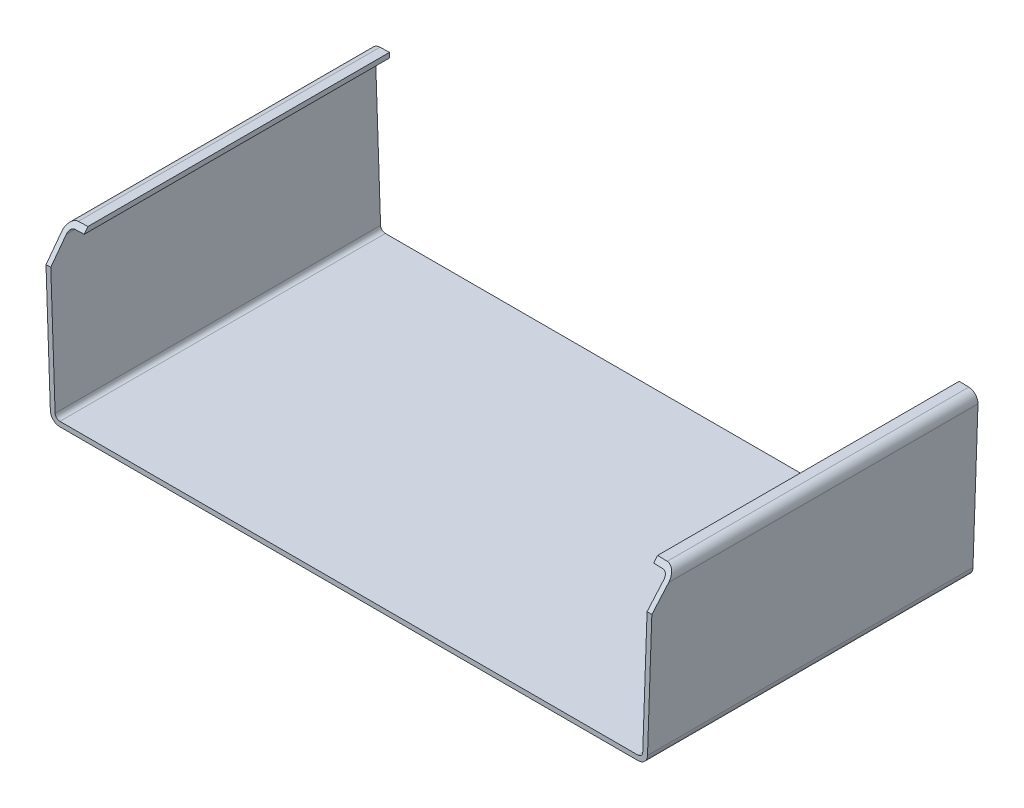
ISO-10303-21;
HEADER;
FILE_DESCRIPTION(('STEP AP214'),'2;1');
FILE_NAME('part.step','',(''),(''),'','','');
FILE_SCHEMA(('AUTOMOTIVE_DESIGN { 1 0 10303 214 1 1 1 1 }'));
ENDSEC;
DATA;
#1=APPLICATION_CONTEXT('core data for automotive mechanical design processes');
#2=APPLICATION_PROTOCOL_DEFINITION('international standard','automotive_design',2000,#1);
#3=PRODUCT_CONTEXT('',#1,'mechanical');
#4=PRODUCT('Part','Part','',(#3));
#5=PRODUCT_RELATED_PRODUCT_CATEGORY('part','',(#4));
#6=PRODUCT_DEFINITION_FORMATION('','',#4);
#7=PRODUCT_DEFINITION_CONTEXT('part definition',#1,'design');
#8=PRODUCT_DEFINITION('design','',#6,#7);
#9=PRODUCT_DEFINITION_SHAPE('','',#8);
#10=(LENGTH_UNIT() NAMED_UNIT(*) SI_UNIT(.MILLI.,.METRE.));
#11=(NAMED_UNIT(*) PLANE_ANGLE_UNIT() SI_UNIT($,.RADIAN.));
#12=(NAMED_UNIT(*) SI_UNIT($,.STERADIAN.) SOLID_ANGLE_UNIT());
#13=UNCERTAINTY_MEASURE_WITH_UNIT(LENGTH_MEASURE(1.E-05),#10,'distance_accuracy_value','');
#14=(GEOMETRIC_REPRESENTATION_CONTEXT(3) GLOBAL_UNCERTAINTY_ASSIGNED_CONTEXT((#13)) GLOBAL_UNIT_ASSIGNED_CONTEXT((#10,
#11,#12)) REPRESENTATION_CONTEXT('',''));
#15=CARTESIAN_POINT('',(0.,0.,0.));
#16=DIRECTION('',(0.,0.,1.));
#17=DIRECTION('',(1.,0.,0.));
#18=AXIS2_PLACEMENT_3D('',#15,#16,#17);
#19=CARTESIAN_POINT('',(-61.5680185949003,1.96509770285898,34.1));
#20=DIRECTION('',(-0.9993907292217,-0.0349022971410098,0.));
#21=DIRECTION('',(0.0349022971410098,-0.9993907292217,0.));
#22=AXIS2_PLACEMENT_3D('',#19,#20,#21);
#23=PLANE('',#22);
#24=DIRECTION('',(-0.0271684032022045,0.777938775156929,-0.627752451189782));
#25=VECTOR('',#24,1.);
#26=CARTESIAN_POINT('',(-61.9263084883444,12.2243536032721,46.8292328661278));
#27=LINE('',#26,#25);
#28=CARTESIAN_POINT('',(-62.4772150285041,27.9989854757474,34.1));
#29=VERTEX_POINT('',#28);
#30=CARTESIAN_POINT('',(-62.6238046764963,32.1964265384786,30.7129032258065));
#31=VERTEX_POINT('',#30);
#32=EDGE_CURVE('E261',#29,#31,#27,.T.);
#33=ORIENTED_EDGE('',*,*,#32,.F.);
#34=DIRECTION('',(-0.0349022971410098,0.9993907292217,0.));
#35=VECTOR('',#34,1.);
#36=CARTESIAN_POINT('',(-61.5680185949003,1.96509770285898,34.1));
#37=LINE('',#36,#35);
#38=CARTESIAN_POINT('',(-61.5680185949003,1.96509770285898,34.1));
#39=VERTEX_POINT('',#38);
#40=EDGE_CURVE('E281',#39,#29,#37,.T.);
#41=ORIENTED_EDGE('',*,*,#40,.F.);
#42=DIRECTION('',(0.,0.,-1.));
#43=VECTOR('',#42,1.);
#44=CARTESIAN_POINT('',(-61.5680185949003,1.96509770285898,34.1));
#45=LINE('',#44,#43);
#46=CARTESIAN_POINT('',(-61.5680185949003,1.96509770285898,-34.1));
#47=VERTEX_POINT('',#46);
#48=EDGE_CURVE('E215',#39,#47,#45,.T.);
#49=ORIENTED_EDGE('',*,*,#48,.T.);
#50=DIRECTION('',(-0.0349022971410098,0.9993907292217,0.));
#51=VECTOR('',#50,1.);
#52=CARTESIAN_POINT('',(-61.5680185949003,1.96509770285898,-34.1));
#53=LINE('',#52,#51);
#54=CARTESIAN_POINT('',(-62.6238046764963,32.1964265384786,-34.1));
#55=VERTEX_POINT('',#54);
#56=EDGE_CURVE('E318',#47,#55,#53,.T.);
#57=ORIENTED_EDGE('',*,*,#56,.T.);
#58=DIRECTION('',(0.,0.,-1.));
#59=VECTOR('',#58,1.);
#60=CARTESIAN_POINT('',(-62.6238046764963,32.1964265384786,34.1));
#61=LINE('',#60,#59);
#62=EDGE_CURVE('E213',#31,#55,#61,.T.);
#63=ORIENTED_EDGE('',*,*,#62,.F.);
#64=EDGE_LOOP('',(#33,#41,#49,#57,#63));
#65=FACE_BOUND('',#64,.T.);
#66=ADVANCED_FACE('F32',(#65),#23,.F.);
#67=CARTESIAN_POINT('',(-61.6244139472746,32.2313288356196,34.1));
#68=DIRECTION('',(0.,0.,-1.));
#69=DIRECTION('',(-1.,0.,0.));
#70=AXIS2_PLACEMENT_3D('',#67,#68,#69);
#71=CYLINDRICAL_SURFACE('',#70,1.);
#72=CARTESIAN_POINT('',(-61.6244139472746,32.2313288356196,30.7129032258065));
#73=DIRECTION('',(-0.0219100025824233,0.627369979965265,0.77841303947533));
#74=DIRECTION('',(-0.0271684032022049,0.777938775156929,-0.627752451189782));
#75=AXIS2_PLACEMENT_3D('',#72,#73,#74);
#76=ELLIPSE('',#75,1.28466501624129,1.);
#77=CARTESIAN_POINT('',(-61.6593162444156,33.2307195648413,29.9064516129032));
#78=VERTEX_POINT('',#77);
#79=EDGE_CURVE('E354',#31,#78,#76,.F.);
#80=ORIENTED_EDGE('',*,*,#79,.F.);
#81=ORIENTED_EDGE('',*,*,#62,.T.);
#82=CARTESIAN_POINT('',(-61.6244139472746,32.2313288356196,-34.1));
#83=DIRECTION('',(0.,0.,-1.));
#84=DIRECTION('',(1.,0.,0.));
#85=AXIS2_PLACEMENT_3D('',#82,#83,#84);
#86=CIRCLE('',#85,1.);
#87=CARTESIAN_POINT('',(-61.6593162444156,33.2307195648413,-34.1));
#88=VERTEX_POINT('',#87);
#89=EDGE_CURVE('E321',#55,#88,#86,.T.);
#90=ORIENTED_EDGE('',*,*,#89,.T.);
#91=DIRECTION('',(0.,0.,-1.));
#92=VECTOR('',#91,1.);
#93=CARTESIAN_POINT('',(-61.6593162444156,33.2307195648413,34.1));
#94=LINE('',#93,#92);
#95=EDGE_CURVE('E211',#78,#88,#94,.T.);
#96=ORIENTED_EDGE('',*,*,#95,.F.);
#97=EDGE_LOOP('',(#80,#81,#90,#96));
#98=FACE_BOUND('',#97,.T.);
#99=ADVANCED_FACE('F427',(#98),#71,.F.);
#100=CARTESIAN_POINT('',(-61.6593162444156,33.2307195648413,34.1));
#101=DIRECTION('',(-0.0349022971410081,0.9993907292217,0.));
#102=DIRECTION('',(-0.9993907292217,-0.0349022971410081,0.));
#103=AXIS2_PLACEMENT_3D('',#100,#101,#102);
#104=PLANE('',#103);
#105=DIRECTION('',(0.9993907292217,0.0349022971410081,0.));
#106=VECTOR('',#105,1.);
#107=CARTESIAN_POINT('',(-61.6593162444156,33.2307195648413,29.9064516129032));
#108=LINE('',#107,#106);
#109=CARTESIAN_POINT('',(-59.658097702859,33.3006092707783,29.9064516129032));
#110=VERTEX_POINT('',#109);
#111=EDGE_CURVE('E356',#78,#110,#108,.T.);
#112=ORIENTED_EDGE('',*,*,#111,.F.);
#113=ORIENTED_EDGE('',*,*,#95,.T.);
#114=DIRECTION('',(0.9993907292217,0.0349022971410081,0.));
#115=VECTOR('',#114,1.);
#116=CARTESIAN_POINT('',(-61.6593162444156,33.2307195648413,-34.1));
#117=LINE('',#116,#115);
#118=CARTESIAN_POINT('',(-59.658097702859,33.3006092707783,-34.1));
#119=VERTEX_POINT('',#118);
#120=EDGE_CURVE('E324',#88,#119,#117,.T.);
#121=ORIENTED_EDGE('',*,*,#120,.T.);
#122=DIRECTION('',(0.,0.,-1.));
#123=VECTOR('',#122,1.);
#124=CARTESIAN_POINT('',(-59.658097702859,33.3006092707783,34.1));
#125=LINE('',#124,#123);
#126=EDGE_CURVE('E209',#110,#119,#125,.T.);
#127=ORIENTED_EDGE('',*,*,#126,.F.);
#128=EDGE_LOOP('',(#112,#113,#121,#127));
#129=FACE_BOUND('',#128,.T.);
#130=ADVANCED_FACE('F430',(#129),#104,.F.);
#131=CARTESIAN_POINT('',(-59.693,34.3,34.1));
#132=DIRECTION('',(-0.9993907292217,-0.03490229714101,0.));
#133=DIRECTION('',(0.03490229714101,-0.9993907292217,0.));
#134=AXIS2_PLACEMENT_3D('',#131,#132,#133);
#135=PLANE('',#134);
#136=DIRECTION('',(-0.0271684032022047,0.777938775156929,-0.627752451189782));
#137=VECTOR('',#136,1.);
#138=CARTESIAN_POINT('',(-59.6077248414745,31.8582351350983,31.0703656998739));
#139=LINE('',#138,#137);
#140=CARTESIAN_POINT('',(-59.693,34.3,29.1));
#141=VERTEX_POINT('',#140);
#142=EDGE_CURVE('E185',#110,#141,#139,.T.);
#143=ORIENTED_EDGE('',*,*,#142,.F.);
#144=ORIENTED_EDGE('',*,*,#126,.T.);
#145=DIRECTION('',(-0.03490229714101,0.9993907292217,0.));
#146=VECTOR('',#145,1.);
#147=CARTESIAN_POINT('',(-59.693,34.3,-34.1));
#148=LINE('',#147,#146);
#149=CARTESIAN_POINT('',(-59.693,34.3,-34.1));
#150=VERTEX_POINT('',#149);
#151=EDGE_CURVE('E327',#119,#150,#148,.T.);
#152=ORIENTED_EDGE('',*,*,#151,.T.);
#153=DIRECTION('',(0.,0.,-1.));
#154=VECTOR('',#153,1.);
#155=CARTESIAN_POINT('',(-59.693,34.3,34.1));
#156=LINE('',#155,#154);
#157=EDGE_CURVE('E202',#141,#150,#156,.T.);
#158=ORIENTED_EDGE('',*,*,#157,.F.);
#159=EDGE_LOOP('',(#143,#144,#152,#158));
#160=FACE_BOUND('',#159,.T.);
#161=ADVANCED_FACE('F366',(#160),#135,.F.);
#162=CARTESIAN_POINT('',(-61.6942185415566,34.230110294063,34.1));
#163=DIRECTION('',(0.0349022971409977,-0.9993907292217,0.));
#164=DIRECTION('',(0.9993907292217,0.0349022971409977,0.));
#165=AXIS2_PLACEMENT_3D('',#162,#163,#164);
#166=PLANE('',#165);
#167=DIRECTION('',(-0.9993907292217,-0.0349022971410102,0.));
#168=VECTOR('',#167,1.);
#169=CARTESIAN_POINT('',(-56.6972648954481,34.404621779768,29.1));
#170=LINE('',#169,#168);
#171=CARTESIAN_POINT('',(-61.6942185415566,34.230110294063,29.1));
#172=VERTEX_POINT('',#171);
#173=EDGE_CURVE('E181',#141,#172,#170,.T.);
#174=ORIENTED_EDGE('',*,*,#173,.F.);
#175=ORIENTED_EDGE('',*,*,#157,.T.);
#176=DIRECTION('',(-0.9993907292217,-0.0349022971409977,0.));
#177=VECTOR('',#176,1.);
#178=CARTESIAN_POINT('',(-61.6942185415566,34.230110294063,-34.1));
#179=LINE('',#178,#177);
#180=CARTESIAN_POINT('',(-61.6942185415566,34.230110294063,-34.1));
#181=VERTEX_POINT('',#180);
#182=EDGE_CURVE('E330',#150,#181,#179,.T.);
#183=ORIENTED_EDGE('',*,*,#182,.T.);
#184=DIRECTION('',(0.,0.,-1.));
#185=VECTOR('',#184,1.);
#186=CARTESIAN_POINT('',(-61.6942185415566,34.230110294063,34.1));
#187=LINE('',#186,#185);
#188=EDGE_CURVE('E199',#172,#181,#187,.T.);
#189=ORIENTED_EDGE('',*,*,#188,.F.);
#190=EDGE_LOOP('',(#174,#175,#183,#189));
#191=FACE_BOUND('',#190,.T.);
#192=ADVANCED_FACE('F365',(#191),#166,.F.);
#193=CARTESIAN_POINT('',(-61.6244139472746,32.2313288356196,34.1));
#194=DIRECTION('',(0.,0.,-1.));
#195=DIRECTION('',(-1.,0.,0.));
#196=AXIS2_PLACEMENT_3D('',#193,#194,#195);
#197=CYLINDRICAL_SURFACE('',#196,2.00000000000001);
#198=CARTESIAN_POINT('',(-61.6244139472746,32.2313288356196,30.7129032258065));
#199=DIRECTION('',(-0.0219100025824233,0.627369979965265,0.77841303947533));
#200=DIRECTION('',(-0.0271684032022049,0.777938775156929,-0.627752451189782));
#201=AXIS2_PLACEMENT_3D('',#198,#199,#200);
#202=ELLIPSE('',#201,2.56933003248257,2.00000000000001);
#203=CARTESIAN_POINT('',(-63.623195405718,32.1615242413376,30.7129032258065));
#204=VERTEX_POINT('',#203);
#205=EDGE_CURVE('E178',#172,#204,#202,.T.);
#206=ORIENTED_EDGE('',*,*,#205,.F.);
#207=ORIENTED_EDGE('',*,*,#188,.T.);
#208=CARTESIAN_POINT('',(-61.6244139472746,32.2313288356196,-34.1));
#209=DIRECTION('',(0.,0.,1.));
#210=DIRECTION('',(1.,0.,0.));
#211=AXIS2_PLACEMENT_3D('',#208,#209,#210);
#212=CIRCLE('',#211,2.00000000000001);
#213=CARTESIAN_POINT('',(-63.623195405718,32.1615242413376,-34.1));
#214=VERTEX_POINT('',#213);
#215=EDGE_CURVE('E197',#181,#214,#212,.T.);
#216=ORIENTED_EDGE('',*,*,#215,.T.);
#217=DIRECTION('',(0.,0.,-1.));
#218=VECTOR('',#217,1.);
#219=CARTESIAN_POINT('',(-63.623195405718,32.1615242413376,34.1));
#220=LINE('',#219,#218);
#221=EDGE_CURVE('E190',#204,#214,#220,.T.);
#222=ORIENTED_EDGE('',*,*,#221,.F.);
#223=EDGE_LOOP('',(#206,#207,#216,#222));
#224=FACE_BOUND('',#223,.T.);
#225=ADVANCED_FACE('F195',(#224),#197,.T.);
#226=CARTESIAN_POINT('',(-62.567409324122,1.93019540571797,34.1));
#227=DIRECTION('',(0.9993907292217,0.0349022971410103,0.));
#228=DIRECTION('',(-0.0349022971410103,0.9993907292217,0.));
#229=AXIS2_PLACEMENT_3D('',#226,#227,#228);
#230=PLANE('',#229);
#231=DIRECTION('',(-0.027168403202205,0.777938775156929,-0.627752451189782));
#232=VECTOR('',#231,1.);
#233=CARTESIAN_POINT('',(-63.693,34.160305699781,29.1));
#234=LINE('',#233,#232);
#235=CARTESIAN_POINT('',(-63.4766057577257,27.9640831786064,34.1));
#236=VERTEX_POINT('',#235);
#237=EDGE_CURVE('E47',#236,#204,#234,.T.);
#238=ORIENTED_EDGE('',*,*,#237,.T.);
#239=ORIENTED_EDGE('',*,*,#221,.T.);
#240=DIRECTION('',(0.0349022971410102,-0.9993907292217,0.));
#241=VECTOR('',#240,1.);
#242=CARTESIAN_POINT('',(-62.567409324122,1.93019540571797,-34.1));
#243=LINE('',#242,#241);
#244=CARTESIAN_POINT('',(-62.567409324122,1.93019540571797,-34.1));
#245=VERTEX_POINT('',#244);
#246=EDGE_CURVE('E333',#214,#245,#243,.T.);
#247=ORIENTED_EDGE('',*,*,#246,.T.);
#248=DIRECTION('',(0.,0.,-1.));
#249=VECTOR('',#248,1.);
#250=CARTESIAN_POINT('',(-62.567409324122,1.93019540571797,34.1));
#251=LINE('',#250,#249);
#252=CARTESIAN_POINT('',(-62.567409324122,1.93019540571797,34.1));
#253=VERTEX_POINT('',#252);
#254=EDGE_CURVE('E200',#253,#245,#251,.T.);
#255=ORIENTED_EDGE('',*,*,#254,.F.);
#256=DIRECTION('',(0.0349022971410102,-0.9993907292217,0.));
#257=VECTOR('',#256,1.);
#258=CARTESIAN_POINT('',(-62.567409324122,1.93019540571797,34.1));
#259=LINE('',#258,#257);
#260=EDGE_CURVE('E193',#236,#253,#259,.T.);
#261=ORIENTED_EDGE('',*,*,#260,.F.);
#262=EDGE_LOOP('',(#238,#239,#247,#255,#261));
#263=FACE_BOUND('',#262,.T.);
#264=ADVANCED_FACE('F189',(#263),#230,.F.);
#265=CARTESIAN_POINT('',(-60.5686278656786,1.99999999999999,34.1));
#266=DIRECTION('',(0.,0.,1.));
#267=DIRECTION('',(1.,0.,0.));
#268=AXIS2_PLACEMENT_3D('',#265,#266,#267);
#269=PLANE('',#268);
#270=ORIENTED_EDGE('',*,*,#40,.T.);
#271=DIRECTION('',(-0.9993907292217,-0.0349022971410103,0.));
#272=VECTOR('',#271,1.);
#273=CARTESIAN_POINT('',(-61.4778242992824,28.0338877728884,34.1));
#274=LINE('',#273,#272);
#275=EDGE_CURVE('E11',#29,#236,#274,.T.);
#276=ORIENTED_EDGE('',*,*,#275,.T.);
#277=ORIENTED_EDGE('',*,*,#260,.T.);
#278=CARTESIAN_POINT('',(-60.5686278656786,1.99999999999999,34.1));
#279=DIRECTION('',(0.,0.,1.));
#280=DIRECTION('',(1.,0.,0.));
#281=AXIS2_PLACEMENT_3D('',#278,#279,#280);
#282=CIRCLE('',#281,2.);
#283=CARTESIAN_POINT('',(-60.5686278656786,0.,34.1));
#284=VERTEX_POINT('',#283);
#285=EDGE_CURVE('E334',#253,#284,#282,.T.);
#286=ORIENTED_EDGE('',*,*,#285,.T.);
#287=DIRECTION('',(1.,0.,0.));
#288=VECTOR('',#287,1.);
#289=CARTESIAN_POINT('',(0.,0.,34.1));
#290=LINE('',#289,#288);
#291=CARTESIAN_POINT('',(60.5686278656786,0.,34.1));
#292=VERTEX_POINT('',#291);
#293=EDGE_CURVE('E272',#284,#292,#290,.T.);
#294=ORIENTED_EDGE('',*,*,#293,.T.);
#295=CARTESIAN_POINT('',(60.5686278656786,1.99999999999999,34.1));
#296=DIRECTION('',(0.,0.,1.));
#297=DIRECTION('',(-1.,0.,0.));
#298=AXIS2_PLACEMENT_3D('',#295,#296,#297);
#299=CIRCLE('',#298,2.);
#300=CARTESIAN_POINT('',(62.567409324122,1.93019540571797,34.1));
#301=VERTEX_POINT('',#300);
#302=EDGE_CURVE('E266',#292,#301,#299,.T.);
#303=ORIENTED_EDGE('',*,*,#302,.T.);
#304=DIRECTION('',(0.0349022971410102,0.9993907292217,0.));
#305=VECTOR('',#304,1.);
#306=CARTESIAN_POINT('',(62.567409324122,1.93019540571797,34.1));
#307=LINE('',#306,#305);
#308=CARTESIAN_POINT('',(63.4766057577258,27.9640831786064,34.1));
#309=VERTEX_POINT('',#308);
#310=EDGE_CURVE('E258',#301,#309,#307,.T.);
#311=ORIENTED_EDGE('',*,*,#310,.T.);
#312=DIRECTION('',(0.9993907292217,-0.0349022971410103,0.));
#313=VECTOR('',#312,1.);
#314=CARTESIAN_POINT('',(-59.511865619381,32.2592802896156,34.1));
#315=LINE('',#314,#313);
#316=CARTESIAN_POINT('',(62.4772150285041,27.9989854757474,34.1));
#317=VERTEX_POINT('',#316);
#318=EDGE_CURVE('E40',#317,#309,#315,.T.);
#319=ORIENTED_EDGE('',*,*,#318,.F.);
#320=DIRECTION('',(-0.0349022971410102,-0.9993907292217,0.));
#321=VECTOR('',#320,1.);
#322=CARTESIAN_POINT('',(61.5680185949003,1.96509770285898,34.1));
#323=LINE('',#322,#321);
#324=CARTESIAN_POINT('',(61.5680185949003,1.96509770285898,34.1));
#325=VERTEX_POINT('',#324);
#326=EDGE_CURVE('E268',#317,#325,#323,.T.);
#327=ORIENTED_EDGE('',*,*,#326,.T.);
#328=CARTESIAN_POINT('',(60.5686278656786,1.99999999999999,34.1));
#329=DIRECTION('',(0.,0.,-1.));
#330=DIRECTION('',(-1.,0.,0.));
#331=AXIS2_PLACEMENT_3D('',#328,#329,#330);
#332=CIRCLE('',#331,0.999999999999997);
#333=CARTESIAN_POINT('',(60.5686278656786,0.999999999999993,34.1));
#334=VERTEX_POINT('',#333);
#335=EDGE_CURVE('E270',#325,#334,#332,.T.);
#336=ORIENTED_EDGE('',*,*,#335,.T.);
#337=DIRECTION('',(-1.,0.,0.));
#338=VECTOR('',#337,1.);
#339=CARTESIAN_POINT('',(0.,1.,34.1));
#340=LINE('',#339,#338);
#341=CARTESIAN_POINT('',(-60.5686278656786,0.999999999999989,34.1));
#342=VERTEX_POINT('',#341);
#343=EDGE_CURVE('E277',#334,#342,#340,.T.);
#344=ORIENTED_EDGE('',*,*,#343,.T.);
#345=CARTESIAN_POINT('',(-60.5686278656786,1.99999999999999,34.1));
#346=DIRECTION('',(0.,0.,-1.));
#347=DIRECTION('',(1.,0.,0.));
#348=AXIS2_PLACEMENT_3D('',#345,#346,#347);
#349=CIRCLE('',#348,1.);
#350=EDGE_CURVE('E279',#342,#39,#349,.T.);
#351=ORIENTED_EDGE('',*,*,#350,.T.);
#352=EDGE_LOOP('',(#270,#276,#277,#286,#294,#303,#311,#319,#327,#336,#344,#351));
#353=FACE_BOUND('',#352,.T.);
#354=ADVANCED_FACE('F264',(#353),#269,.T.);
#355=CARTESIAN_POINT('',(-60.5686278656786,1.99999999999999,34.1));
#356=DIRECTION('',(0.,0.,-1.));
#357=DIRECTION('',(-1.,0.,0.));
#358=AXIS2_PLACEMENT_3D('',#355,#356,#357);
#359=CYLINDRICAL_SURFACE('',#358,2.);
#360=CARTESIAN_POINT('',(-60.5686278656786,1.99999999999999,-34.1));
#361=DIRECTION('',(0.,0.,1.));
#362=DIRECTION('',(1.,0.,0.));
#363=AXIS2_PLACEMENT_3D('',#360,#361,#362);
#364=CIRCLE('',#363,2.);
#365=CARTESIAN_POINT('',(-60.5686278656786,0.,-34.1));
#366=VERTEX_POINT('',#365);
#367=EDGE_CURVE('E284',#245,#366,#364,.T.);
#368=ORIENTED_EDGE('',*,*,#367,.T.);
#369=DIRECTION('',(0.,0.,-1.));
#370=VECTOR('',#369,1.);
#371=CARTESIAN_POINT('',(-60.5686278656786,0.,34.1));
#372=LINE('',#371,#370);
#373=EDGE_CURVE('E245',#284,#366,#372,.T.);
#374=ORIENTED_EDGE('',*,*,#373,.F.);
#375=ORIENTED_EDGE('',*,*,#285,.F.);
#376=ORIENTED_EDGE('',*,*,#254,.T.);
#377=EDGE_LOOP('',(#368,#374,#375,#376));
#378=FACE_BOUND('',#377,.T.);
#379=ADVANCED_FACE('F34',(#378),#359,.T.);
#380=CARTESIAN_POINT('',(0.,0.,34.1));
#381=DIRECTION('',(0.,1.,0.));
#382=DIRECTION('',(-1.,0.,0.));
#383=AXIS2_PLACEMENT_3D('',#380,#381,#382);
#384=PLANE('',#383);
#385=DIRECTION('',(1.,0.,0.));
#386=VECTOR('',#385,1.);
#387=CARTESIAN_POINT('',(0.,0.,-34.1));
#388=LINE('',#387,#386);
#389=CARTESIAN_POINT('',(60.5686278656786,0.,-34.1));
#390=VERTEX_POINT('',#389);
#391=EDGE_CURVE('E287',#366,#390,#388,.T.);
#392=ORIENTED_EDGE('',*,*,#391,.T.);
#393=DIRECTION('',(0.,0.,-1.));
#394=VECTOR('',#393,1.);
#395=CARTESIAN_POINT('',(60.5686278656786,0.,34.1));
#396=LINE('',#395,#394);
#397=EDGE_CURVE('E242',#292,#390,#396,.T.);
#398=ORIENTED_EDGE('',*,*,#397,.F.);
#399=ORIENTED_EDGE('',*,*,#293,.F.);
#400=ORIENTED_EDGE('',*,*,#373,.T.);
#401=EDGE_LOOP('',(#392,#398,#399,#400));
#402=FACE_BOUND('',#401,.T.);
#403=ADVANCED_FACE('F376',(#402),#384,.F.);
#404=CARTESIAN_POINT('',(60.5686278656786,1.99999999999999,34.1));
#405=DIRECTION('',(0.,0.,-1.));
#406=DIRECTION('',(-1.,0.,0.));
#407=AXIS2_PLACEMENT_3D('',#404,#405,#406);
#408=CYLINDRICAL_SURFACE('',#407,2.);
#409=CARTESIAN_POINT('',(60.5686278656786,1.99999999999999,-34.1));
#410=DIRECTION('',(0.,0.,1.));
#411=DIRECTION('',(-1.,0.,0.));
#412=AXIS2_PLACEMENT_3D('',#409,#410,#411);
#413=CIRCLE('',#412,2.);
#414=CARTESIAN_POINT('',(62.567409324122,1.93019540571797,-34.1));
#415=VERTEX_POINT('',#414);
#416=EDGE_CURVE('E290',#390,#415,#413,.T.);
#417=ORIENTED_EDGE('',*,*,#416,.T.);
#418=DIRECTION('',(0.,0.,-1.));
#419=VECTOR('',#418,1.);
#420=CARTESIAN_POINT('',(62.567409324122,1.93019540571797,34.1));
#421=LINE('',#420,#419);
#422=EDGE_CURVE('E239',#301,#415,#421,.T.);
#423=ORIENTED_EDGE('',*,*,#422,.F.);
#424=ORIENTED_EDGE('',*,*,#302,.F.);
#425=ORIENTED_EDGE('',*,*,#397,.T.);
#426=EDGE_LOOP('',(#417,#423,#424,#425));
#427=FACE_BOUND('',#426,.T.);
#428=ADVANCED_FACE('F379',(#427),#408,.T.);
#429=CARTESIAN_POINT('',(62.567409324122,1.93019540571797,34.1));
#430=DIRECTION('',(-0.9993907292217,0.0349022971410103,0.));
#431=DIRECTION('',(-0.0349022971410103,-0.9993907292217,0.));
#432=AXIS2_PLACEMENT_3D('',#429,#430,#431);
#433=PLANE('',#432);
#434=DIRECTION('',(0.,0.,-1.));
#435=VECTOR('',#434,1.);
#436=CARTESIAN_POINT('',(63.623195405718,32.1615242413376,34.1));
#437=LINE('',#436,#435);
#438=CARTESIAN_POINT('',(63.623195405718,32.1615242413376,30.7129032258065));
#439=VERTEX_POINT('',#438);
#440=CARTESIAN_POINT('',(63.623195405718,32.1615242413376,-34.1));
#441=VERTEX_POINT('',#440);
#442=EDGE_CURVE('E237',#439,#441,#437,.T.);
#443=ORIENTED_EDGE('',*,*,#442,.F.);
#444=DIRECTION('',(0.027168403202205,0.777938775156929,-0.627752451189782));
#445=VECTOR('',#444,1.);
#446=CARTESIAN_POINT('',(63.693,34.160305699781,29.1));
#447=LINE('',#446,#445);
#448=EDGE_CURVE('E249',#309,#439,#447,.T.);
#449=ORIENTED_EDGE('',*,*,#448,.F.);
#450=ORIENTED_EDGE('',*,*,#310,.F.);
#451=ORIENTED_EDGE('',*,*,#422,.T.);
#452=DIRECTION('',(0.0349022971410102,0.9993907292217,0.));
#453=VECTOR('',#452,1.);
#454=CARTESIAN_POINT('',(62.567409324122,1.93019540571797,-34.1));
#455=LINE('',#454,#453);
#456=EDGE_CURVE('E292',#415,#441,#455,.T.);
#457=ORIENTED_EDGE('',*,*,#456,.T.);
#458=EDGE_LOOP('',(#443,#449,#450,#451,#457));
#459=FACE_BOUND('',#458,.T.);
#460=ADVANCED_FACE('F257',(#459),#433,.F.);
#461=CARTESIAN_POINT('',(61.6244139472746,32.2313288356196,34.1));
#462=DIRECTION('',(0.,0.,-1.));
#463=DIRECTION('',(-1.,0.,0.));
#464=AXIS2_PLACEMENT_3D('',#461,#462,#463);
#465=CYLINDRICAL_SURFACE('',#464,2.00000000000001);
#466=DIRECTION('',(0.,0.,-1.));
#467=VECTOR('',#466,1.);
#468=CARTESIAN_POINT('',(61.6942185415566,34.230110294063,34.1));
#469=LINE('',#468,#467);
#470=CARTESIAN_POINT('',(61.6942185415566,34.230110294063,29.1));
#471=VERTEX_POINT('',#470);
#472=CARTESIAN_POINT('',(61.6942185415566,34.230110294063,-34.1));
#473=VERTEX_POINT('',#472);
#474=EDGE_CURVE('E235',#471,#473,#469,.T.);
#475=ORIENTED_EDGE('',*,*,#474,.F.);
#476=CARTESIAN_POINT('',(61.6244139472746,32.2313288356196,30.7129032258065));
#477=DIRECTION('',(-0.0219100025824233,-0.627369979965265,-0.77841303947533));
#478=DIRECTION('',(0.0271684032022049,0.777938775156929,-0.627752451189782));
#479=AXIS2_PLACEMENT_3D('',#476,#477,#478);
#480=ELLIPSE('',#479,2.56933003248257,2.00000000000001);
#481=EDGE_CURVE('E288',#471,#439,#480,.T.);
#482=ORIENTED_EDGE('',*,*,#481,.T.);
#483=ORIENTED_EDGE('',*,*,#442,.T.);
#484=CARTESIAN_POINT('',(61.6244139472746,32.2313288356196,-34.1));
#485=DIRECTION('',(0.,0.,1.));
#486=DIRECTION('',(-1.,0.,0.));
#487=AXIS2_PLACEMENT_3D('',#484,#485,#486);
#488=CIRCLE('',#487,2.00000000000001);
#489=EDGE_CURVE('E294',#441,#473,#488,.T.);
#490=ORIENTED_EDGE('',*,*,#489,.T.);
#491=EDGE_LOOP('',(#475,#482,#483,#490));
#492=FACE_BOUND('',#491,.T.);
#493=ADVANCED_FACE('F386',(#492),#465,.T.);
#494=CARTESIAN_POINT('',(61.6942185415566,34.230110294063,34.1));
#495=DIRECTION('',(-0.0349022971409977,-0.9993907292217,0.));
#496=DIRECTION('',(0.9993907292217,-0.0349022971409977,0.));
#497=AXIS2_PLACEMENT_3D('',#494,#495,#496);
#498=PLANE('',#497);
#499=DIRECTION('',(0.,0.,-1.));
#500=VECTOR('',#499,1.);
#501=CARTESIAN_POINT('',(59.693,34.3,34.1));
#502=LINE('',#501,#500);
#503=CARTESIAN_POINT('',(59.693,34.3,29.1));
#504=VERTEX_POINT('',#503);
#505=CARTESIAN_POINT('',(59.693,34.3,-34.1));
#506=VERTEX_POINT('',#505);
#507=EDGE_CURVE('E233',#504,#506,#502,.T.);
#508=ORIENTED_EDGE('',*,*,#507,.F.);
#509=DIRECTION('',(0.9993907292217,-0.0349022971410102,0.));
#510=VECTOR('',#509,1.);
#511=CARTESIAN_POINT('',(56.6972648954481,34.404621779768,29.1));
#512=LINE('',#511,#510);
#513=EDGE_CURVE('E260',#504,#471,#512,.T.);
#514=ORIENTED_EDGE('',*,*,#513,.T.);
#515=ORIENTED_EDGE('',*,*,#474,.T.);
#516=DIRECTION('',(-0.9993907292217,0.0349022971409977,0.));
#517=VECTOR('',#516,1.);
#518=CARTESIAN_POINT('',(61.6942185415566,34.230110294063,-34.1));
#519=LINE('',#518,#517);
#520=EDGE_CURVE('E297',#473,#506,#519,.T.);
#521=ORIENTED_EDGE('',*,*,#520,.T.);
#522=EDGE_LOOP('',(#508,#514,#515,#521));
#523=FACE_BOUND('',#522,.T.);
#524=ADVANCED_FACE('F389',(#523),#498,.F.);
#525=CARTESIAN_POINT('',(59.693,34.3,34.1));
#526=DIRECTION('',(0.9993907292217,-0.0349022971410098,0.));
#527=DIRECTION('',(0.0349022971410098,0.9993907292217,0.));
#528=AXIS2_PLACEMENT_3D('',#525,#526,#527);
#529=PLANE('',#528);
#530=DIRECTION('',(0.,0.,-1.));
#531=VECTOR('',#530,1.);
#532=CARTESIAN_POINT('',(59.658097702859,33.3006092707783,34.1));
#533=LINE('',#532,#531);
#534=CARTESIAN_POINT('',(59.658097702859,33.3006092707783,29.9064516129032));
#535=VERTEX_POINT('',#534);
#536=CARTESIAN_POINT('',(59.658097702859,33.3006092707783,-34.1));
#537=VERTEX_POINT('',#536);
#538=EDGE_CURVE('E231',#535,#537,#533,.T.);
#539=ORIENTED_EDGE('',*,*,#538,.F.);
#540=DIRECTION('',(0.0271684032022046,0.777938775156929,-0.627752451189782));
#541=VECTOR('',#540,1.);
#542=CARTESIAN_POINT('',(59.6077248414745,31.8582351350983,31.0703656998739));
#543=LINE('',#542,#541);
#544=EDGE_CURVE('E341',#535,#504,#543,.T.);
#545=ORIENTED_EDGE('',*,*,#544,.T.);
#546=ORIENTED_EDGE('',*,*,#507,.T.);
#547=DIRECTION('',(-0.0349022971410098,-0.9993907292217,0.));
#548=VECTOR('',#547,1.);
#549=CARTESIAN_POINT('',(59.693,34.3,-34.1));
#550=LINE('',#549,#548);
#551=EDGE_CURVE('E300',#506,#537,#550,.T.);
#552=ORIENTED_EDGE('',*,*,#551,.T.);
#553=EDGE_LOOP('',(#539,#545,#546,#552));
#554=FACE_BOUND('',#553,.T.);
#555=ADVANCED_FACE('F392',(#554),#529,.F.);
#556=CARTESIAN_POINT('',(61.6593162444156,33.2307195648413,34.1));
#557=DIRECTION('',(0.0349022971409977,0.9993907292217,0.));
#558=DIRECTION('',(-0.9993907292217,0.0349022971409977,0.));
#559=AXIS2_PLACEMENT_3D('',#556,#557,#558);
#560=PLANE('',#559);
#561=DIRECTION('',(0.,0.,-1.));
#562=VECTOR('',#561,1.);
#563=CARTESIAN_POINT('',(61.6593162444156,33.2307195648413,34.1));
#564=LINE('',#563,#562);
#565=CARTESIAN_POINT('',(61.6593162444156,33.2307195648413,29.9064516129032));
#566=VERTEX_POINT('',#565);
#567=CARTESIAN_POINT('',(61.6593162444156,33.2307195648413,-34.1));
#568=VERTEX_POINT('',#567);
#569=EDGE_CURVE('E229',#566,#568,#564,.T.);
#570=ORIENTED_EDGE('',*,*,#569,.F.);
#571=DIRECTION('',(-0.9993907292217,0.0349022971409977,0.));
#572=VECTOR('',#571,1.);
#573=CARTESIAN_POINT('',(61.6593162444155,33.2307195648413,29.9064516129032));
#574=LINE('',#573,#572);
#575=EDGE_CURVE('E344',#566,#535,#574,.T.);
#576=ORIENTED_EDGE('',*,*,#575,.T.);
#577=ORIENTED_EDGE('',*,*,#538,.T.);
#578=DIRECTION('',(0.9993907292217,-0.0349022971409977,0.));
#579=VECTOR('',#578,1.);
#580=CARTESIAN_POINT('',(61.6593162444156,33.2307195648413,-34.1));
#581=LINE('',#580,#579);
#582=EDGE_CURVE('E303',#537,#568,#581,.T.);
#583=ORIENTED_EDGE('',*,*,#582,.T.);
#584=EDGE_LOOP('',(#570,#576,#577,#583));
#585=FACE_BOUND('',#584,.T.);
#586=ADVANCED_FACE('F396',(#585),#560,.F.);
#587=CARTESIAN_POINT('',(61.6244139472746,32.2313288356196,34.1));
#588=DIRECTION('',(0.,0.,-1.));
#589=DIRECTION('',(-1.,0.,0.));
#590=AXIS2_PLACEMENT_3D('',#587,#588,#589);
#591=CYLINDRICAL_SURFACE('',#590,1.00000000000001);
#592=DIRECTION('',(0.,0.,-1.));
#593=VECTOR('',#592,1.);
#594=CARTESIAN_POINT('',(62.6238046764963,32.1964265384786,34.1));
#595=LINE('',#594,#593);
#596=CARTESIAN_POINT('',(62.6238046764963,32.1964265384786,30.7129032258065));
#597=VERTEX_POINT('',#596);
#598=CARTESIAN_POINT('',(62.6238046764963,32.1964265384786,-34.1));
#599=VERTEX_POINT('',#598);
#600=EDGE_CURVE('E227',#597,#599,#595,.T.);
#601=ORIENTED_EDGE('',*,*,#600,.F.);
#602=CARTESIAN_POINT('',(61.6244139472746,32.2313288356196,30.7129032258065));
#603=DIRECTION('',(-0.0219100025824233,-0.627369979965265,-0.77841303947533));
#604=DIRECTION('',(0.0271684032022049,0.777938775156929,-0.627752451189782));
#605=AXIS2_PLACEMENT_3D('',#602,#603,#604);
#606=ELLIPSE('',#605,1.2846650162413,1.00000000000001);
#607=EDGE_CURVE('E347',#597,#566,#606,.F.);
#608=ORIENTED_EDGE('',*,*,#607,.T.);
#609=ORIENTED_EDGE('',*,*,#569,.T.);
#610=CARTESIAN_POINT('',(61.6244139472746,32.2313288356196,-34.1));
#611=DIRECTION('',(0.,0.,-1.));
#612=DIRECTION('',(-1.,0.,0.));
#613=AXIS2_PLACEMENT_3D('',#610,#611,#612);
#614=CIRCLE('',#613,1.00000000000001);
#615=EDGE_CURVE('E306',#568,#599,#614,.T.);
#616=ORIENTED_EDGE('',*,*,#615,.T.);
#617=EDGE_LOOP('',(#601,#608,#609,#616));
#618=FACE_BOUND('',#617,.T.);
#619=ADVANCED_FACE('F400',(#618),#591,.F.);
#620=CARTESIAN_POINT('',(61.5680185949003,1.96509770285898,34.1));
#621=DIRECTION('',(0.9993907292217,-0.0349022971410103,0.));
#622=DIRECTION('',(0.0349022971410103,0.9993907292217,0.));
#623=AXIS2_PLACEMENT_3D('',#620,#621,#622);
#624=PLANE('',#623);
#625=ORIENTED_EDGE('',*,*,#326,.F.);
#626=DIRECTION('',(0.0271684032022049,0.777938775156929,-0.627752451189782));
#627=VECTOR('',#626,1.);
#628=CARTESIAN_POINT('',(61.9263084883444,12.2243536032721,46.8292328661278));
#629=LINE('',#628,#627);
#630=EDGE_CURVE('E54',#317,#597,#629,.T.);
#631=ORIENTED_EDGE('',*,*,#630,.T.);
#632=ORIENTED_EDGE('',*,*,#600,.T.);
#633=DIRECTION('',(-0.0349022971410102,-0.9993907292217,0.));
#634=VECTOR('',#633,1.);
#635=CARTESIAN_POINT('',(61.5680185949003,1.96509770285898,-34.1));
#636=LINE('',#635,#634);
#637=CARTESIAN_POINT('',(61.5680185949003,1.96509770285898,-34.1));
#638=VERTEX_POINT('',#637);
#639=EDGE_CURVE('E309',#599,#638,#636,.T.);
#640=ORIENTED_EDGE('',*,*,#639,.T.);
#641=DIRECTION('',(0.,0.,-1.));
#642=VECTOR('',#641,1.);
#643=CARTESIAN_POINT('',(61.5680185949003,1.96509770285898,34.1));
#644=LINE('',#643,#642);
#645=EDGE_CURVE('E224',#325,#638,#644,.T.);
#646=ORIENTED_EDGE('',*,*,#645,.F.);
#647=EDGE_LOOP('',(#625,#631,#632,#640,#646));
#648=FACE_BOUND('',#647,.T.);
#649=ADVANCED_FACE('F403',(#648),#624,.F.);
#650=CARTESIAN_POINT('',(60.5686278656786,1.99999999999999,34.1));
#651=DIRECTION('',(0.,0.,-1.));
#652=DIRECTION('',(-1.,0.,0.));
#653=AXIS2_PLACEMENT_3D('',#650,#651,#652);
#654=CYLINDRICAL_SURFACE('',#653,0.999999999999997);
#655=CARTESIAN_POINT('',(60.5686278656786,1.99999999999999,-34.1));
#656=DIRECTION('',(0.,0.,-1.));
#657=DIRECTION('',(-1.,0.,0.));
#658=AXIS2_PLACEMENT_3D('',#655,#656,#657);
#659=CIRCLE('',#658,0.999999999999997);
#660=CARTESIAN_POINT('',(60.5686278656786,0.999999999999993,-34.1));
#661=VERTEX_POINT('',#660);
#662=EDGE_CURVE('E311',#638,#661,#659,.T.);
#663=ORIENTED_EDGE('',*,*,#662,.T.);
#664=DIRECTION('',(0.,0.,-1.));
#665=VECTOR('',#664,1.);
#666=CARTESIAN_POINT('',(60.5686278656786,0.999999999999993,34.1));
#667=LINE('',#666,#665);
#668=EDGE_CURVE('E221',#334,#661,#667,.T.);
#669=ORIENTED_EDGE('',*,*,#668,.F.);
#670=ORIENTED_EDGE('',*,*,#335,.F.);
#671=ORIENTED_EDGE('',*,*,#645,.T.);
#672=EDGE_LOOP('',(#663,#669,#670,#671));
#673=FACE_BOUND('',#672,.T.);
#674=ADVANCED_FACE('F410',(#673),#654,.F.);
#675=CARTESIAN_POINT('',(0.,1.,34.1));
#676=DIRECTION('',(0.,-1.,0.));
#677=DIRECTION('',(1.,0.,0.));
#678=AXIS2_PLACEMENT_3D('',#675,#676,#677);
#679=PLANE('',#678);
#680=DIRECTION('',(-1.,0.,0.));
#681=VECTOR('',#680,1.);
#682=CARTESIAN_POINT('',(0.,1.,-34.1));
#683=LINE('',#682,#681);
#684=CARTESIAN_POINT('',(-60.5686278656786,0.999999999999989,-34.1));
#685=VERTEX_POINT('',#684);
#686=EDGE_CURVE('E314',#661,#685,#683,.T.);
#687=ORIENTED_EDGE('',*,*,#686,.T.);
#688=DIRECTION('',(0.,0.,-1.));
#689=VECTOR('',#688,1.);
#690=CARTESIAN_POINT('',(-60.5686278656786,0.999999999999989,34.1));
#691=LINE('',#690,#689);
#692=EDGE_CURVE('E218',#342,#685,#691,.T.);
#693=ORIENTED_EDGE('',*,*,#692,.F.);
#694=ORIENTED_EDGE('',*,*,#343,.F.);
#695=ORIENTED_EDGE('',*,*,#668,.T.);
#696=EDGE_LOOP('',(#687,#693,#694,#695));
#697=FACE_BOUND('',#696,.T.);
#698=ADVANCED_FACE('F413',(#697),#679,.F.);
#699=CARTESIAN_POINT('',(-60.5686278656786,1.99999999999999,34.1));
#700=DIRECTION('',(0.,0.,-1.));
#701=DIRECTION('',(-1.,0.,0.));
#702=AXIS2_PLACEMENT_3D('',#699,#700,#701);
#703=CYLINDRICAL_SURFACE('',#702,1.);
#704=CARTESIAN_POINT('',(-60.5686278656786,1.99999999999999,-34.1));
#705=DIRECTION('',(0.,0.,-1.));
#706=DIRECTION('',(1.,0.,0.));
#707=AXIS2_PLACEMENT_3D('',#704,#705,#706);
#708=CIRCLE('',#707,1.);
#709=EDGE_CURVE('E316',#685,#47,#708,.T.);
#710=ORIENTED_EDGE('',*,*,#709,.T.);
#711=ORIENTED_EDGE('',*,*,#48,.F.);
#712=ORIENTED_EDGE('',*,*,#350,.F.);
#713=ORIENTED_EDGE('',*,*,#692,.T.);
#714=EDGE_LOOP('',(#710,#711,#712,#713));
#715=FACE_BOUND('',#714,.T.);
#716=ADVANCED_FACE('F418',(#715),#703,.F.);
#717=CARTESIAN_POINT('',(-60.5686278656786,1.99999999999999,-34.1));
#718=DIRECTION('',(0.,0.,1.));
#719=DIRECTION('',(1.,0.,0.));
#720=AXIS2_PLACEMENT_3D('',#717,#718,#719);
#721=PLANE('',#720);
#722=ORIENTED_EDGE('',*,*,#367,.F.);
#723=ORIENTED_EDGE('',*,*,#246,.F.);
#724=ORIENTED_EDGE('',*,*,#215,.F.);
#725=ORIENTED_EDGE('',*,*,#182,.F.);
#726=ORIENTED_EDGE('',*,*,#151,.F.);
#727=ORIENTED_EDGE('',*,*,#120,.F.);
#728=ORIENTED_EDGE('',*,*,#89,.F.);
#729=ORIENTED_EDGE('',*,*,#56,.F.);
#730=ORIENTED_EDGE('',*,*,#709,.F.);
#731=ORIENTED_EDGE('',*,*,#686,.F.);
#732=ORIENTED_EDGE('',*,*,#662,.F.);
#733=ORIENTED_EDGE('',*,*,#639,.F.);
#734=ORIENTED_EDGE('',*,*,#615,.F.);
#735=ORIENTED_EDGE('',*,*,#582,.F.);
#736=ORIENTED_EDGE('',*,*,#551,.F.);
#737=ORIENTED_EDGE('',*,*,#520,.F.);
#738=ORIENTED_EDGE('',*,*,#489,.F.);
#739=ORIENTED_EDGE('',*,*,#456,.F.);
#740=ORIENTED_EDGE('',*,*,#416,.F.);
#741=ORIENTED_EDGE('',*,*,#391,.F.);
#742=EDGE_LOOP('',(#722,#723,#724,#725,#726,#727,#728,#729,#730,#731,#732,#733,#734,#735,#736,
#737,#738,#739,#740,#741));
#743=FACE_BOUND('',#742,.T.);
#744=ADVANCED_FACE('F372',(#743),#721,.F.);
#745=CARTESIAN_POINT('',(56.6972648954481,34.404621779768,29.1));
#746=DIRECTION('',(-0.0219100025824233,-0.627369979965265,-0.77841303947533));
#747=DIRECTION('',(0.,0.778599944665,-0.627520618121555));
#748=AXIS2_PLACEMENT_3D('',#745,#746,#747);
#749=PLANE('',#748);
#750=ORIENTED_EDGE('',*,*,#513,.F.);
#751=ORIENTED_EDGE('',*,*,#544,.F.);
#752=ORIENTED_EDGE('',*,*,#575,.F.);
#753=ORIENTED_EDGE('',*,*,#607,.F.);
#754=ORIENTED_EDGE('',*,*,#630,.F.);
#755=ORIENTED_EDGE('',*,*,#318,.T.);
#756=ORIENTED_EDGE('',*,*,#448,.T.);
#757=ORIENTED_EDGE('',*,*,#481,.F.);
#758=EDGE_LOOP('',(#750,#751,#752,#753,#754,#755,#756,#757));
#759=FACE_BOUND('',#758,.T.);
#760=ADVANCED_FACE('F248',(#759),#749,.F.);
#761=CARTESIAN_POINT('',(-56.6972648954481,34.404621779768,29.1));
#762=DIRECTION('',(-0.0219100025824233,0.627369979965265,0.77841303947533));
#763=DIRECTION('',(0.,-0.778599944665,0.627520618121555));
#764=AXIS2_PLACEMENT_3D('',#761,#762,#763);
#765=PLANE('',#764);
#766=ORIENTED_EDGE('',*,*,#32,.T.);
#767=ORIENTED_EDGE('',*,*,#79,.T.);
#768=ORIENTED_EDGE('',*,*,#111,.T.);
#769=ORIENTED_EDGE('',*,*,#142,.T.);
#770=ORIENTED_EDGE('',*,*,#173,.T.);
#771=ORIENTED_EDGE('',*,*,#205,.T.);
#772=ORIENTED_EDGE('',*,*,#237,.F.);
#773=ORIENTED_EDGE('',*,*,#275,.F.);
#774=EDGE_LOOP('',(#766,#767,#768,#769,#770,#771,#772,#773));
#775=FACE_BOUND('',#774,.T.);
#776=ADVANCED_FACE('F179',(#775),#765,.T.);
#777=CLOSED_SHELL('',(#66,#99,#130,#161,#192,#225,#264,#354,#379,#403,#428,#460,#493,#524,#555,
#586,#619,#649,#674,#698,#716,#744,#760,#776));
#778=MANIFOLD_SOLID_BREP('B2',#777);
#779=ADVANCED_BREP_SHAPE_REPRESENTATION('',(#18,#778),#14);
#780=SHAPE_DEFINITION_REPRESENTATION(#9,#779);
ENDSEC;
END-ISO-10303-21;
